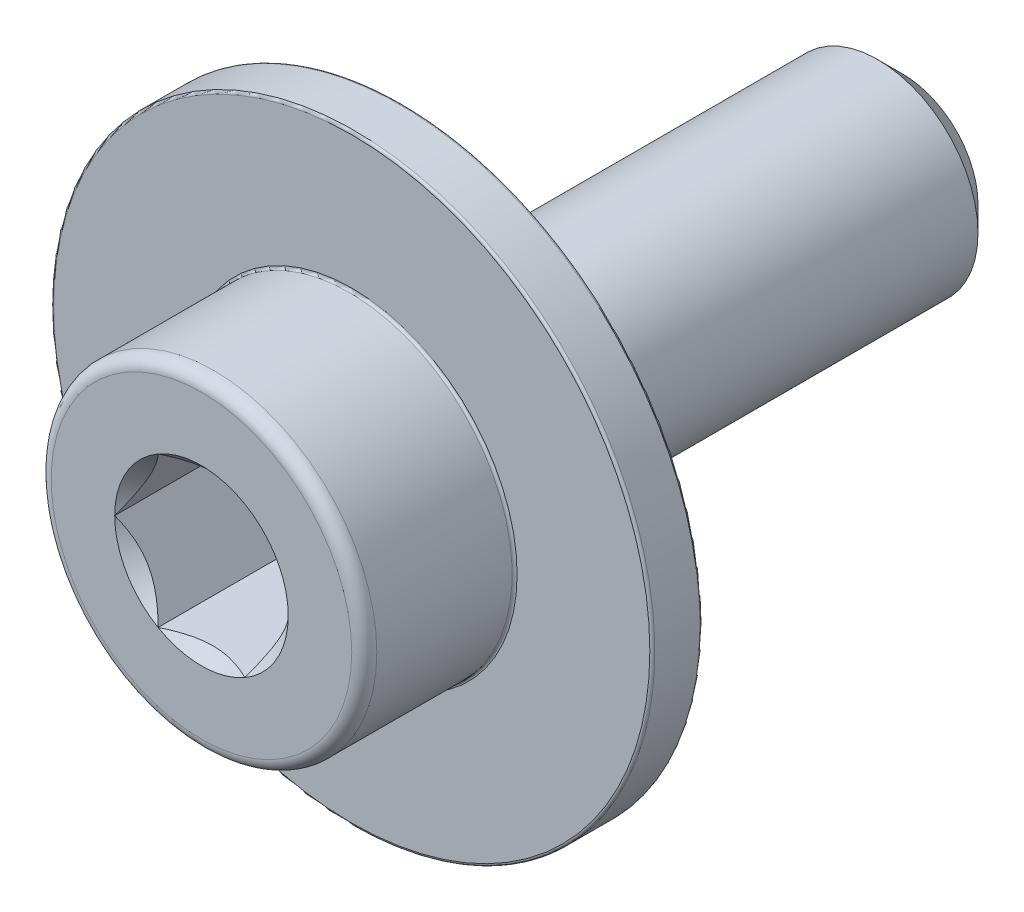
ISO-10303-21;
HEADER;
FILE_DESCRIPTION(('STEP AP214'),'2;1');
FILE_NAME('part.step','',(''),(''),'','','');
FILE_SCHEMA(('AUTOMOTIVE_DESIGN { 1 0 10303 214 1 1 1 1 }'));
ENDSEC;
DATA;
#1=APPLICATION_CONTEXT('core data for automotive mechanical design processes');
#2=APPLICATION_PROTOCOL_DEFINITION('international standard','automotive_design',2000,#1);
#3=PRODUCT_CONTEXT('',#1,'mechanical');
#4=PRODUCT('Part','Part','',(#3));
#5=PRODUCT_RELATED_PRODUCT_CATEGORY('part','',(#4));
#6=PRODUCT_DEFINITION_FORMATION('','',#4);
#7=PRODUCT_DEFINITION_CONTEXT('part definition',#1,'design');
#8=PRODUCT_DEFINITION('design','',#6,#7);
#9=PRODUCT_DEFINITION_SHAPE('','',#8);
#10=(LENGTH_UNIT() NAMED_UNIT(*) SI_UNIT(.MILLI.,.METRE.));
#11=(NAMED_UNIT(*) PLANE_ANGLE_UNIT() SI_UNIT($,.RADIAN.));
#12=(NAMED_UNIT(*) SI_UNIT($,.STERADIAN.) SOLID_ANGLE_UNIT());
#13=UNCERTAINTY_MEASURE_WITH_UNIT(LENGTH_MEASURE(1.E-05),#10,'distance_accuracy_value','');
#14=(GEOMETRIC_REPRESENTATION_CONTEXT(3) GLOBAL_UNCERTAINTY_ASSIGNED_CONTEXT((#13)) GLOBAL_UNIT_ASSIGNED_CONTEXT((#10,
#11,#12)) REPRESENTATION_CONTEXT('',''));
#15=CARTESIAN_POINT('',(0.,0.,0.));
#16=DIRECTION('',(0.,0.,1.));
#17=DIRECTION('',(1.,0.,0.));
#18=AXIS2_PLACEMENT_3D('',#15,#16,#17);
#19=CARTESIAN_POINT('',(0.,0.,28.));
#20=DIRECTION('',(0.,0.,-1.));
#21=DIRECTION('',(-1.,0.,0.));
#22=AXIS2_PLACEMENT_3D('',#19,#20,#21);
#23=CYLINDRICAL_SURFACE('',#22,6.5);
#24=CARTESIAN_POINT('',(0.,0.,22.1));
#25=DIRECTION('',(0.,0.,-1.));
#26=DIRECTION('',(-1.,0.,0.));
#27=AXIS2_PLACEMENT_3D('',#24,#25,#26);
#28=CIRCLE('',#27,6.5);
#29=CARTESIAN_POINT('',(-6.5,0.,22.1));
#30=VERTEX_POINT('',#29);
#31=EDGE_CURVE('E11',#30,#30,#28,.F.);
#32=ORIENTED_EDGE('',*,*,#31,.T.);
#33=EDGE_LOOP('',(#32));
#34=FACE_BOUND('',#33,.T.);
#35=CARTESIAN_POINT('',(0.,0.,27.5));
#36=DIRECTION('',(0.,0.,1.));
#37=DIRECTION('',(1.,0.,0.));
#38=AXIS2_PLACEMENT_3D('',#35,#36,#37);
#39=CIRCLE('',#38,6.5);
#40=CARTESIAN_POINT('',(6.5,0.,27.5));
#41=VERTEX_POINT('',#40);
#42=EDGE_CURVE('E257',#41,#41,#39,.F.);
#43=ORIENTED_EDGE('',*,*,#42,.T.);
#44=EDGE_LOOP('',(#43));
#45=FACE_BOUND('',#44,.T.);
#46=ADVANCED_FACE('F35',(#34,#45),#23,.T.);
#47=CARTESIAN_POINT('',(0.,0.,28.));
#48=DIRECTION('',(0.,0.,1.));
#49=DIRECTION('',(1.,0.,0.));
#50=AXIS2_PLACEMENT_3D('',#47,#48,#49);
#51=PLANE('',#50);
#52=CARTESIAN_POINT('',(0.,0.,28.));
#53=DIRECTION('',(0.,0.,1.));
#54=DIRECTION('',(1.,0.,0.));
#55=AXIS2_PLACEMENT_3D('',#52,#53,#54);
#56=CIRCLE('',#55,6.);
#57=CARTESIAN_POINT('',(6.,0.,28.));
#58=VERTEX_POINT('',#57);
#59=EDGE_CURVE('E108',#58,#58,#56,.T.);
#60=ORIENTED_EDGE('',*,*,#59,.T.);
#61=EDGE_LOOP('',(#60));
#62=FACE_BOUND('',#61,.T.);
#63=CARTESIAN_POINT('',(0.,0.,28.));
#64=DIRECTION('',(0.,0.,1.));
#65=DIRECTION('',(1.,0.,0.));
#66=AXIS2_PLACEMENT_3D('',#63,#64,#65);
#67=CIRCLE('',#66,3.46410161513776);
#68=CARTESIAN_POINT('',(3.46410161513776,0.,28.));
#69=VERTEX_POINT('',#68);
#70=CARTESIAN_POINT('',(1.73205080756888,3.,28.));
#71=VERTEX_POINT('',#70);
#72=EDGE_CURVE('E89',#69,#71,#67,.T.);
#73=ORIENTED_EDGE('',*,*,#72,.F.);
#74=CARTESIAN_POINT('',(1.73205080756888,-3.,28.));
#75=VERTEX_POINT('',#74);
#76=EDGE_CURVE('E49',#75,#69,#67,.T.);
#77=ORIENTED_EDGE('',*,*,#76,.F.);
#78=CARTESIAN_POINT('',(-1.73205080756888,-3.,28.));
#79=VERTEX_POINT('',#78);
#80=EDGE_CURVE('E319',#79,#75,#67,.T.);
#81=ORIENTED_EDGE('',*,*,#80,.F.);
#82=CARTESIAN_POINT('',(-3.46410161513776,0.,28.));
#83=VERTEX_POINT('',#82);
#84=EDGE_CURVE('E56',#83,#79,#67,.T.);
#85=ORIENTED_EDGE('',*,*,#84,.F.);
#86=CARTESIAN_POINT('',(-1.73205080756888,3.,28.));
#87=VERTEX_POINT('',#86);
#88=EDGE_CURVE('E130',#87,#83,#67,.T.);
#89=ORIENTED_EDGE('',*,*,#88,.F.);
#90=EDGE_CURVE('E98',#71,#87,#67,.T.);
#91=ORIENTED_EDGE('',*,*,#90,.F.);
#92=EDGE_LOOP('',(#73,#77,#81,#85,#89,#91));
#93=FACE_BOUND('',#92,.T.);
#94=ADVANCED_FACE('F129',(#62,#93),#51,.T.);
#95=CARTESIAN_POINT('',(0.,0.,28.));
#96=DIRECTION('',(0.,0.,1.));
#97=DIRECTION('',(1.,0.,0.));
#98=AXIS2_PLACEMENT_3D('',#95,#96,#97);
#99=CONICAL_SURFACE('',#98,3.46410161513776,0.785398163397449);
#100=ORIENTED_EDGE('',*,*,#90,.T.);
#101=CARTESIAN_POINT('',(-3.40188153141397,3.,29.071623018675));
#102=CARTESIAN_POINT('',(-3.31880839496225,3.,29.0093307707653));
#103=CARTESIAN_POINT('',(-3.23526432463499,3.,28.9476562262713));
#104=CARTESIAN_POINT('',(-3.06705083944725,3.,28.825817186681));
#105=CARTESIAN_POINT('',(-2.98238114192822,3.,28.7656530822642));
#106=CARTESIAN_POINT('',(-2.81111390830011,3.,28.6466823260063));
#107=CARTESIAN_POINT('',(-2.72450651479474,3.,28.5878898159252));
#108=CARTESIAN_POINT('',(-2.5498128465526,3.,28.4725516902232));
#109=CARTESIAN_POINT('',(-2.46172667795769,3.,28.4160059143113));
#110=CARTESIAN_POINT('',(-2.27892768432208,3.,28.3026064434241));
#111=CARTESIAN_POINT('',(-2.1841177229421,3.,28.2459085325007));
#112=CARTESIAN_POINT('',(-1.99231796342786,3.,28.1363338489189));
#113=CARTESIAN_POINT('',(-1.89532845598629,3.,28.0834565706102));
#114=CARTESIAN_POINT('',(-1.6991502417869,3.,27.9826433846406));
#115=CARTESIAN_POINT('',(-1.59996871640864,3.,27.9346936118117));
#116=CARTESIAN_POINT('',(-1.39893527870468,3.,27.8448170133997));
#117=CARTESIAN_POINT('',(-1.29708458210817,3.,27.8028875002659));
#118=CARTESIAN_POINT('',(-1.0982186531427,3.,27.7293601977538));
#119=CARTESIAN_POINT('',(-1.00140329048655,3.,27.6972274830937));
#120=CARTESIAN_POINT('',(-0.805487586800685,3.,27.6407367466802));
#121=CARTESIAN_POINT('',(-0.706387084473375,3.,27.6163792755582));
#122=CARTESIAN_POINT('',(-0.508116211624926,3.,27.5771014895869));
#123=CARTESIAN_POINT('',(-0.408977763183684,3.,27.5620226377466));
#124=CARTESIAN_POINT('',(-0.209698791301063,3.,27.5415865192691));
#125=CARTESIAN_POINT('',(-0.109558431989066,3.,27.5362276857281));
#126=CARTESIAN_POINT('',(0.0873520516843386,3.,27.535609235846));
#127=CARTESIAN_POINT('',(0.184121252918254,3.,27.5400131533177));
#128=CARTESIAN_POINT('',(0.376804854524576,3.,27.557946416793));
#129=CARTESIAN_POINT('',(0.472719169351943,3.,27.5714766658715));
#130=CARTESIAN_POINT('',(0.664619663322418,3.,27.6071635369876));
#131=CARTESIAN_POINT('',(0.760578448954831,3.,27.6294651712297));
#132=CARTESIAN_POINT('',(0.950411386335506,3.,27.6815211461887));
#133=CARTESIAN_POINT('',(1.04428572934496,3.,27.7112748000321));
#134=CARTESIAN_POINT('',(1.23968230612517,3.,27.7805237867733));
#135=CARTESIAN_POINT('',(1.34095401081408,3.,27.8207192131534));
#136=CARTESIAN_POINT('',(1.54084264319092,3.,27.9072590407946));
#137=CARTESIAN_POINT('',(1.63945865301323,3.,27.9536055360041));
#138=CARTESIAN_POINT('',(1.83454570215359,3.,28.0513511324151));
#139=CARTESIAN_POINT('',(1.93100848905254,3.,28.1027665721575));
#140=CARTESIAN_POINT('',(2.12170828880385,3.,28.209507618301));
#141=CARTESIAN_POINT('',(2.21594570238894,3.,28.2648325134343));
#142=CARTESIAN_POINT('',(2.39783630702513,3.,28.3757799204079));
#143=CARTESIAN_POINT('',(2.48558325753569,3.,28.4312495308021));
#144=CARTESIAN_POINT('',(2.65957133871346,3.,28.5445092718899));
#145=CARTESIAN_POINT('',(2.74581235420106,3.,28.6022995789736));
#146=CARTESIAN_POINT('',(2.91628413803161,3.,28.7193054641893));
#147=CARTESIAN_POINT('',(3.00052556721126,3.,28.7785055655618));
#148=CARTESIAN_POINT('',(3.16785911169907,3.,28.8984622960703));
#149=CARTESIAN_POINT('',(3.25095153629611,3.,28.9592184932626));
#150=CARTESIAN_POINT('',(3.33356317170769,3.,29.0206105740407));
#151=B_SPLINE_CURVE_WITH_KNOTS('',3,(#101,#102,#103,#104,#105,#106,#107,#108,#109,#110,#111,
#112,#113,#114,#115,#116,#117,#118,#119,#120,#121,#122,#123,#124,#125,#126,#127,#128,#129,#130,
#131,#132,#133,#134,#135,#136,#137,#138,#139,#140,#141,#142,#143,#144,#145,#146,#147,#148,#149,
#150),.UNSPECIFIED.,.F.,.F.,(4,2,2,2,2,2,2,2,2,2,2,2,2,2,2,2,2,2,2,2,2,2,2,2,4),(0.,
0.311507889644127,0.623095538398645,0.937099065704866,1.25108015037407,1.58241857439006,
1.91371306604159,2.24404824101607,2.57423548692227,2.87999017792551,3.18576651722764,
3.486161620239,3.78650829411698,4.07666515932723,4.36685074054528,4.6620503227987,
4.95722270569223,5.28383771583299,5.61056419890145,5.93838056110906,6.26613743475899,
6.57752286720456,6.88893201218749,7.19780024979462,7.50658366111557),.UNSPECIFIED.);
#152=EDGE_CURVE('E103',#71,#87,#151,.F.);
#153=ORIENTED_EDGE('',*,*,#152,.F.);
#154=EDGE_LOOP('',(#100,#153));
#155=FACE_BOUND('',#154,.T.);
#156=ADVANCED_FACE('F104',(#155),#99,.F.);
#157=ORIENTED_EDGE('',*,*,#88,.T.);
#158=CARTESIAN_POINT('',(-1.73193533751504,3.0002,28.0001154758271));
#159=CARTESIAN_POINT('',(-1.79147372663452,2.89707648504425,27.9406283183218));
#160=CARTESIAN_POINT('',(-1.85200767512883,2.79222861066935,27.8846349794655));
#161=CARTESIAN_POINT('',(-1.97544301635334,2.5784323282189,27.7821125963789));
#162=CARTESIAN_POINT('',(-2.03835614749388,2.46946358862024,27.7356405937413));
#163=CARTESIAN_POINT('',(-2.16521745390422,2.24973336040297,27.6560331885163));
#164=CARTESIAN_POINT('',(-2.22913332270057,2.13902782823779,27.6226977006427));
#165=CARTESIAN_POINT('',(-2.35837216363117,1.91517958943467,27.5713375439793));
#166=CARTESIAN_POINT('',(-2.42369118784644,1.802043720793,27.5532745375356));
#167=CARTESIAN_POINT('',(-2.53626564359199,1.60705904380729,27.5369769084505));
#168=CARTESIAN_POINT('',(-2.58337569224233,1.52546204599786,27.5345643671738));
#169=CARTESIAN_POINT('',(-2.67751916315866,1.36240077116991,27.5386294346571));
#170=CARTESIAN_POINT('',(-2.7245525527757,1.28093655070101,27.5451101600283));
#171=CARTESIAN_POINT('',(-2.81817374583237,1.11877988766163,27.5665917225152));
#172=CARTESIAN_POINT('',(-2.86476099147974,1.03808841121569,27.5816020899673));
#173=CARTESIAN_POINT('',(-2.95713536549225,0.878091302108662,27.619323646066));
#174=CARTESIAN_POINT('',(-3.00292255491614,0.798785563690702,27.6420342443228));
#175=CARTESIAN_POINT('',(-3.0842086834051,0.657993859197245,27.6887606848539));
#176=CARTESIAN_POINT('',(-3.11988753362891,0.596196277853973,27.7115483276808));
#177=CARTESIAN_POINT('',(-3.19060468282508,0.473710582479779,27.7607962860574));
#178=CARTESIAN_POINT('',(-3.2256429622163,0.413022502364395,27.7872567136662));
#179=CARTESIAN_POINT('',(-3.29496858432308,0.292947002609136,27.8432569943914));
#180=CARTESIAN_POINT('',(-3.32925789884291,0.233556167704081,27.8727871644784));
#181=CARTESIAN_POINT('',(-3.39720147685869,0.115874438532731,27.9345390915755));
#182=CARTESIAN_POINT('',(-3.43085611477447,0.0575828957522658,27.9667591966594));
#183=CARTESIAN_POINT('',(-3.46421708519159,-0.000200000000000237,28.0001154758271));
#184=B_SPLINE_CURVE_WITH_KNOTS('',3,(#158,#159,#160,#161,#162,#163,#164,#165,#166,#167,#168,
#169,#170,#171,#172,#173,#174,#175,#176,#177,#178,#179,#180,#181,#182,#183),.UNSPECIFIED.,.F.,
.F.,(4,2,2,2,2,2,2,2,2,2,2,2,4),(0.,0.399603557139307,0.801535286397847,1.19708369162343,
1.59163620080173,1.87398941755845,2.15644160919093,2.43921001247426,2.72195674032138,
2.94657516661927,3.17120044767274,3.3951375283781,3.61893808380739),.UNSPECIFIED.);
#185=EDGE_CURVE('E97',#87,#83,#184,.T.);
#186=ORIENTED_EDGE('',*,*,#185,.F.);
#187=EDGE_LOOP('',(#157,#186));
#188=FACE_BOUND('',#187,.T.);
#189=ADVANCED_FACE('F325',(#188),#99,.F.);
#190=ORIENTED_EDGE('',*,*,#84,.T.);
#191=CARTESIAN_POINT('',(-3.46421708519159,0.000199999999999766,28.0001154758271));
#192=CARTESIAN_POINT('',(-3.40467869607211,-0.102923514955749,27.9406283183218));
#193=CARTESIAN_POINT('',(-3.3441447475778,-0.207771389330651,27.8846349794655));
#194=CARTESIAN_POINT('',(-3.22070940635329,-0.421567671781097,27.7821125963789));
#195=CARTESIAN_POINT('',(-3.15779627521275,-0.53053641137976,27.7356405937413));
#196=CARTESIAN_POINT('',(-3.03093496880241,-0.750266639597028,27.6560331885163));
#197=CARTESIAN_POINT('',(-2.96701910000606,-0.860972171762212,27.6226977006427));
#198=CARTESIAN_POINT('',(-2.83778025907546,-1.08482041056532,27.5713375439793));
#199=CARTESIAN_POINT('',(-2.77246123486019,-1.19795627920699,27.5532745375356));
#200=CARTESIAN_POINT('',(-2.65988677911464,-1.3929409561927,27.5369769084505));
#201=CARTESIAN_POINT('',(-2.6127767304643,-1.47453795400213,27.5345643671738));
#202=CARTESIAN_POINT('',(-2.51863325954798,-1.63759922883009,27.5386294346571));
#203=CARTESIAN_POINT('',(-2.47159986993094,-1.71906344929899,27.5451101600283));
#204=CARTESIAN_POINT('',(-2.37797867687426,-1.88122011233837,27.5665917225152));
#205=CARTESIAN_POINT('',(-2.33139143122689,-1.9619115887843,27.5816020899673));
#206=CARTESIAN_POINT('',(-2.23901705721438,-2.12190869789133,27.619323646066));
#207=CARTESIAN_POINT('',(-2.19322986779049,-2.20121443630929,27.6420342443228));
#208=CARTESIAN_POINT('',(-2.11194373930153,-2.34200614080275,27.6887606848539));
#209=CARTESIAN_POINT('',(-2.07626488907772,-2.40380372214602,27.7115483276808));
#210=CARTESIAN_POINT('',(-2.00554773988155,-2.52628941752022,27.7607962860574));
#211=CARTESIAN_POINT('',(-1.97050946049033,-2.5869774976356,27.7872567136662));
#212=CARTESIAN_POINT('',(-1.90118383838356,-2.70705299739086,27.8432569943914));
#213=CARTESIAN_POINT('',(-1.86689452386373,-2.76644383229592,27.8727871644784));
#214=CARTESIAN_POINT('',(-1.79895094584794,-2.88412556146727,27.9345390915755));
#215=CARTESIAN_POINT('',(-1.76529630793216,-2.94241710424774,27.9667591966594));
#216=CARTESIAN_POINT('',(-1.73193533751504,-3.0002,28.0001154758271));
#217=B_SPLINE_CURVE_WITH_KNOTS('',3,(#191,#192,#193,#194,#195,#196,#197,#198,#199,#200,#201,
#202,#203,#204,#205,#206,#207,#208,#209,#210,#211,#212,#213,#214,#215,#216),.UNSPECIFIED.,.F.,
.F.,(4,2,2,2,2,2,2,2,2,2,2,2,4),(0.,0.399603557139307,0.801535286397845,1.19708369162343,
1.59163620080173,1.87398941755844,2.15644160919092,2.43921001247425,2.72195674032138,
2.94657516661926,3.17120044767274,3.3951375283781,3.61893808380739),.UNSPECIFIED.);
#218=EDGE_CURVE('E140',#83,#79,#217,.T.);
#219=ORIENTED_EDGE('',*,*,#218,.F.);
#220=EDGE_LOOP('',(#190,#219));
#221=FACE_BOUND('',#220,.T.);
#222=ADVANCED_FACE('F327',(#221),#99,.F.);
#223=ORIENTED_EDGE('',*,*,#80,.T.);
#224=CARTESIAN_POINT('',(-3.40188153141397,-3.,29.071623018675));
#225=CARTESIAN_POINT('',(-3.31880839496224,-3.,29.0093307707653));
#226=CARTESIAN_POINT('',(-3.23526432463498,-3.,28.9476562262713));
#227=CARTESIAN_POINT('',(-3.06705083944724,-3.,28.825817186681));
#228=CARTESIAN_POINT('',(-2.98238114192821,-3.,28.7656530822642));
#229=CARTESIAN_POINT('',(-2.81111390830011,-3.,28.6466823260063));
#230=CARTESIAN_POINT('',(-2.72450651479473,-3.,28.5878898159252));
#231=CARTESIAN_POINT('',(-2.54981284655259,-3.,28.4725516902232));
#232=CARTESIAN_POINT('',(-2.46172667795768,-3.,28.4160059143113));
#233=CARTESIAN_POINT('',(-2.27892768432207,-3.,28.3026064434241));
#234=CARTESIAN_POINT('',(-2.18411772294209,-3.,28.2459085325007));
#235=CARTESIAN_POINT('',(-1.99231796342786,-3.,28.1363338489189));
#236=CARTESIAN_POINT('',(-1.89532845598629,-3.,28.0834565706102));
#237=CARTESIAN_POINT('',(-1.69915024178689,-3.,27.9826433846406));
#238=CARTESIAN_POINT('',(-1.59996871640864,-3.,27.9346936118117));
#239=CARTESIAN_POINT('',(-1.39893527870468,-3.,27.8448170133997));
#240=CARTESIAN_POINT('',(-1.29708458210817,-3.,27.8028875002659));
#241=CARTESIAN_POINT('',(-1.0982186531427,-3.,27.7293601977538));
#242=CARTESIAN_POINT('',(-1.00140329048654,-3.,27.6972274830937));
#243=CARTESIAN_POINT('',(-0.805487586800682,-3.,27.6407367466802));
#244=CARTESIAN_POINT('',(-0.706387084473371,-3.,27.6163792755582));
#245=CARTESIAN_POINT('',(-0.508116211624922,-3.,27.5771014895869));
#246=CARTESIAN_POINT('',(-0.40897776318368,-3.,27.5620226377466));
#247=CARTESIAN_POINT('',(-0.20969879130106,-3.,27.5415865192691));
#248=CARTESIAN_POINT('',(-0.109558431989063,-3.,27.5362276857281));
#249=CARTESIAN_POINT('',(0.087352051684342,-3.,27.535609235846));
#250=CARTESIAN_POINT('',(0.184121252918257,-3.,27.5400131533177));
#251=CARTESIAN_POINT('',(0.376804854524579,-3.,27.557946416793));
#252=CARTESIAN_POINT('',(0.472719169351946,-3.,27.5714766658715));
#253=CARTESIAN_POINT('',(0.664619663322421,-3.,27.6071635369876));
#254=CARTESIAN_POINT('',(0.760578448954834,-3.,27.6294651712297));
#255=CARTESIAN_POINT('',(0.950411386335509,-3.,27.6815211461887));
#256=CARTESIAN_POINT('',(1.04428572934496,-3.,27.7112748000321));
#257=CARTESIAN_POINT('',(1.23968230612517,-3.,27.7805237867733));
#258=CARTESIAN_POINT('',(1.34095401081408,-3.,27.8207192131534));
#259=CARTESIAN_POINT('',(1.54084264319093,-3.,27.9072590407946));
#260=CARTESIAN_POINT('',(1.63945865301323,-3.,27.9536055360041));
#261=CARTESIAN_POINT('',(1.8345457021536,-3.,28.0513511324151));
#262=CARTESIAN_POINT('',(1.93100848905254,-3.,28.1027665721575));
#263=CARTESIAN_POINT('',(2.12170828880386,-3.,28.2095076183011));
#264=CARTESIAN_POINT('',(2.21594570238895,-3.,28.2648325134343));
#265=CARTESIAN_POINT('',(2.39783630702514,-3.,28.3757799204079));
#266=CARTESIAN_POINT('',(2.48558325753569,-3.,28.4312495308021));
#267=CARTESIAN_POINT('',(2.65957133871347,-3.,28.5445092718899));
#268=CARTESIAN_POINT('',(2.74581235420107,-3.,28.6022995789736));
#269=CARTESIAN_POINT('',(2.91628413803161,-3.,28.7193054641893));
#270=CARTESIAN_POINT('',(3.00052556721127,-3.,28.7785055655619));
#271=CARTESIAN_POINT('',(3.16785911169908,-3.,28.8984622960703));
#272=CARTESIAN_POINT('',(3.25095153629611,-3.,28.9592184932626));
#273=CARTESIAN_POINT('',(3.3335631717077,-3.,29.0206105740407));
#274=B_SPLINE_CURVE_WITH_KNOTS('',3,(#224,#225,#226,#227,#228,#229,#230,#231,#232,#233,#234,
#235,#236,#237,#238,#239,#240,#241,#242,#243,#244,#245,#246,#247,#248,#249,#250,#251,#252,#253,
#254,#255,#256,#257,#258,#259,#260,#261,#262,#263,#264,#265,#266,#267,#268,#269,#270,#271,#272,
#273),.UNSPECIFIED.,.F.,.F.,(4,2,2,2,2,2,2,2,2,2,2,2,2,2,2,2,2,2,2,2,2,2,2,2,4),(0.,
0.311507889644127,0.62309553839864,0.937099065704863,1.25108015037407,1.58241857439005,
1.91371306604158,2.24404824101606,2.57423548692226,2.8799901779255,3.18576651722763,
3.486161620239,3.78650829411697,4.07666515932722,4.36685074054527,4.66205032279869,
4.95722270569222,5.28383771583299,5.61056419890145,5.93838056110906,6.26613743475899,
6.57752286720455,6.88893201218749,7.19780024979462,7.50658366111556),.UNSPECIFIED.);
#275=EDGE_CURVE('E170',#79,#75,#274,.T.);
#276=ORIENTED_EDGE('',*,*,#275,.F.);
#277=EDGE_LOOP('',(#223,#276));
#278=FACE_BOUND('',#277,.T.);
#279=ADVANCED_FACE('F320',(#278),#99,.F.);
#280=ORIENTED_EDGE('',*,*,#76,.T.);
#281=CARTESIAN_POINT('',(1.73193533751504,-3.0002,28.0001154758272));
#282=CARTESIAN_POINT('',(1.79147372663452,-2.89707648504425,27.9406283183218));
#283=CARTESIAN_POINT('',(1.85200767512883,-2.79222861066935,27.8846349794655));
#284=CARTESIAN_POINT('',(1.97544301635334,-2.57843232821891,27.7821125963789));
#285=CARTESIAN_POINT('',(2.03835614749388,-2.46946358862024,27.7356405937413));
#286=CARTESIAN_POINT('',(2.16521745390422,-2.24973336040297,27.6560331885163));
#287=CARTESIAN_POINT('',(2.22913332270057,-2.13902782823779,27.6226977006427));
#288=CARTESIAN_POINT('',(2.35837216363117,-1.91517958943468,27.5713375439793));
#289=CARTESIAN_POINT('',(2.42369118784644,-1.80204372079301,27.5532745375356));
#290=CARTESIAN_POINT('',(2.53626564359199,-1.6070590438073,27.5369769084505));
#291=CARTESIAN_POINT('',(2.58337569224233,-1.52546204599787,27.5345643671738));
#292=CARTESIAN_POINT('',(2.67751916315865,-1.36240077116991,27.5386294346571));
#293=CARTESIAN_POINT('',(2.7245525527757,-1.28093655070101,27.5451101600283));
#294=CARTESIAN_POINT('',(2.81817374583237,-1.11877988766163,27.5665917225152));
#295=CARTESIAN_POINT('',(2.86476099147974,-1.0380884112157,27.5816020899673));
#296=CARTESIAN_POINT('',(2.95713536549225,-0.878091302108666,27.619323646066));
#297=CARTESIAN_POINT('',(3.00292255491614,-0.798785563690705,27.6420342443228));
#298=CARTESIAN_POINT('',(3.0842086834051,-0.657993859197248,27.6887606848539));
#299=CARTESIAN_POINT('',(3.11988753362891,-0.596196277853976,27.7115483276808));
#300=CARTESIAN_POINT('',(3.19060468282508,-0.473710582479782,27.7607962860574));
#301=CARTESIAN_POINT('',(3.2256429622163,-0.413022502364398,27.7872567136662));
#302=CARTESIAN_POINT('',(3.29496858432308,-0.292947002609139,27.8432569943914));
#303=CARTESIAN_POINT('',(3.32925789884291,-0.233556167704084,27.8727871644784));
#304=CARTESIAN_POINT('',(3.39720147685869,-0.115874438532733,27.9345390915755));
#305=CARTESIAN_POINT('',(3.43085611477447,-0.0575828957522672,27.9667591966594));
#306=CARTESIAN_POINT('',(3.46421708519159,0.000199999999999132,28.0001154758271));
#307=B_SPLINE_CURVE_WITH_KNOTS('',3,(#281,#282,#283,#284,#285,#286,#287,#288,#289,#290,#291,
#292,#293,#294,#295,#296,#297,#298,#299,#300,#301,#302,#303,#304,#305,#306),.UNSPECIFIED.,.F.,
.F.,(4,2,2,2,2,2,2,2,2,2,2,2,4),(0.,0.399603557139308,0.801535286397848,1.19708369162343,
1.59163620080173,1.87398941755845,2.15644160919093,2.43921001247425,2.72195674032138,
2.94657516661927,3.17120044767274,3.3951375283781,3.61893808380739),.UNSPECIFIED.);
#308=EDGE_CURVE('E119',#75,#69,#307,.T.);
#309=ORIENTED_EDGE('',*,*,#308,.F.);
#310=EDGE_LOOP('',(#280,#309));
#311=FACE_BOUND('',#310,.T.);
#312=ADVANCED_FACE('F155',(#311),#99,.F.);
#313=ORIENTED_EDGE('',*,*,#72,.T.);
#314=CARTESIAN_POINT('',(3.46421708519159,-0.000199999999999999,28.0001154758272));
#315=CARTESIAN_POINT('',(3.40467869607211,0.102923514955748,27.9406283183218));
#316=CARTESIAN_POINT('',(3.3441447475778,0.20777138933065,27.8846349794655));
#317=CARTESIAN_POINT('',(3.2207094063533,0.421567671781096,27.7821125963789));
#318=CARTESIAN_POINT('',(3.15779627521275,0.53053641137976,27.7356405937413));
#319=CARTESIAN_POINT('',(3.03093496880242,0.750266639597029,27.6560331885163));
#320=CARTESIAN_POINT('',(2.96701910000607,0.860972171762213,27.6226977006427));
#321=CARTESIAN_POINT('',(2.83778025907546,1.08482041056533,27.5713375439793));
#322=CARTESIAN_POINT('',(2.7724612348602,1.197956279207,27.5532745375356));
#323=CARTESIAN_POINT('',(2.65988677911464,1.3929409561927,27.5369769084505));
#324=CARTESIAN_POINT('',(2.6127767304643,1.47453795400214,27.5345643671738));
#325=CARTESIAN_POINT('',(2.51863325954798,1.63759922883009,27.5386294346571));
#326=CARTESIAN_POINT('',(2.47159986993094,1.71906344929899,27.5451101600283));
#327=CARTESIAN_POINT('',(2.37797867687426,1.88122011233837,27.5665917225152));
#328=CARTESIAN_POINT('',(2.33139143122689,1.9619115887843,27.5816020899673));
#329=CARTESIAN_POINT('',(2.23901705721438,2.12190869789134,27.619323646066));
#330=CARTESIAN_POINT('',(2.19322986779049,2.2012144363093,27.6420342443228));
#331=CARTESIAN_POINT('',(2.11194373930153,2.34200614080275,27.6887606848539));
#332=CARTESIAN_POINT('',(2.07626488907772,2.40380372214603,27.7115483276808));
#333=CARTESIAN_POINT('',(2.00554773988155,2.52628941752022,27.7607962860574));
#334=CARTESIAN_POINT('',(1.97050946049034,2.5869774976356,27.7872567136662));
#335=CARTESIAN_POINT('',(1.90118383838356,2.70705299739086,27.8432569943914));
#336=CARTESIAN_POINT('',(1.86689452386373,2.76644383229592,27.8727871644784));
#337=CARTESIAN_POINT('',(1.79895094584795,2.88412556146727,27.9345390915755));
#338=CARTESIAN_POINT('',(1.76529630793217,2.94241710424774,27.9667591966594));
#339=CARTESIAN_POINT('',(1.73193533751504,3.0002,28.0001154758271));
#340=B_SPLINE_CURVE_WITH_KNOTS('',3,(#314,#315,#316,#317,#318,#319,#320,#321,#322,#323,#324,
#325,#326,#327,#328,#329,#330,#331,#332,#333,#334,#335,#336,#337,#338,#339),.UNSPECIFIED.,.F.,
.F.,(4,2,2,2,2,2,2,2,2,2,2,2,4),(0.,0.399603557139308,0.801535286397847,1.19708369162343,
1.59163620080173,1.87398941755845,2.15644160919093,2.43921001247425,2.72195674032138,
2.94657516661927,3.17120044767275,3.3951375283781,3.61893808380739),.UNSPECIFIED.);
#341=EDGE_CURVE('E93',#69,#71,#340,.T.);
#342=ORIENTED_EDGE('',*,*,#341,.F.);
#343=EDGE_LOOP('',(#313,#342));
#344=FACE_BOUND('',#343,.T.);
#345=ADVANCED_FACE('F91',(#344),#99,.F.);
#346=CARTESIAN_POINT('',(0.,0.,22.));
#347=DIRECTION('',(0.,0.,1.));
#348=DIRECTION('',(1.,0.,0.));
#349=AXIS2_PLACEMENT_3D('',#346,#347,#348);
#350=PLANE('',#349);
#351=DIRECTION('',(-0.5,0.866025403784439,0.));
#352=VECTOR('',#351,1.);
#353=CARTESIAN_POINT('',(3.46410161513776,0.,22.));
#354=LINE('',#353,#352);
#355=CARTESIAN_POINT('',(3.46410161513776,0.,22.));
#356=VERTEX_POINT('',#355);
#357=CARTESIAN_POINT('',(1.73205080756888,3.,22.));
#358=VERTEX_POINT('',#357);
#359=EDGE_CURVE('E118',#356,#358,#354,.T.);
#360=ORIENTED_EDGE('',*,*,#359,.T.);
#361=DIRECTION('',(-1.,0.,0.));
#362=VECTOR('',#361,1.);
#363=CARTESIAN_POINT('',(1.73205080756888,3.,22.));
#364=LINE('',#363,#362);
#365=CARTESIAN_POINT('',(-1.73205080756888,3.,22.));
#366=VERTEX_POINT('',#365);
#367=EDGE_CURVE('E123',#358,#366,#364,.T.);
#368=ORIENTED_EDGE('',*,*,#367,.T.);
#369=DIRECTION('',(-0.5,-0.866025403784439,0.));
#370=VECTOR('',#369,1.);
#371=CARTESIAN_POINT('',(-1.73205080756888,3.,22.));
#372=LINE('',#371,#370);
#373=CARTESIAN_POINT('',(-3.46410161513775,0.,22.));
#374=VERTEX_POINT('',#373);
#375=EDGE_CURVE('E309',#366,#374,#372,.T.);
#376=ORIENTED_EDGE('',*,*,#375,.T.);
#377=DIRECTION('',(0.5,-0.866025403784439,0.));
#378=VECTOR('',#377,1.);
#379=CARTESIAN_POINT('',(-3.46410161513775,0.,22.));
#380=LINE('',#379,#378);
#381=CARTESIAN_POINT('',(-1.73205080756887,-3.,22.));
#382=VERTEX_POINT('',#381);
#383=EDGE_CURVE('E306',#374,#382,#380,.T.);
#384=ORIENTED_EDGE('',*,*,#383,.T.);
#385=DIRECTION('',(1.,0.,0.));
#386=VECTOR('',#385,1.);
#387=CARTESIAN_POINT('',(-1.73205080756887,-3.,22.));
#388=LINE('',#387,#386);
#389=CARTESIAN_POINT('',(1.73205080756888,-3.,22.));
#390=VERTEX_POINT('',#389);
#391=EDGE_CURVE('E303',#382,#390,#388,.T.);
#392=ORIENTED_EDGE('',*,*,#391,.T.);
#393=DIRECTION('',(0.5,0.866025403784439,0.));
#394=VECTOR('',#393,1.);
#395=CARTESIAN_POINT('',(1.73205080756888,-3.,22.));
#396=LINE('',#395,#394);
#397=EDGE_CURVE('E126',#390,#356,#396,.T.);
#398=ORIENTED_EDGE('',*,*,#397,.T.);
#399=EDGE_LOOP('',(#360,#368,#376,#384,#392,#398));
#400=FACE_BOUND('',#399,.T.);
#401=ADVANCED_FACE('F154',(#400),#350,.T.);
#402=CARTESIAN_POINT('',(1.73205080756888,3.,22.));
#403=DIRECTION('',(0.,1.,0.));
#404=DIRECTION('',(-1.,0.,0.));
#405=AXIS2_PLACEMENT_3D('',#402,#403,#404);
#406=PLANE('',#405);
#407=DIRECTION('',(0.,0.,1.));
#408=VECTOR('',#407,1.);
#409=CARTESIAN_POINT('',(1.73205080756888,3.,22.));
#410=LINE('',#409,#408);
#411=EDGE_CURVE('E115',#358,#71,#410,.T.);
#412=ORIENTED_EDGE('',*,*,#411,.T.);
#413=ORIENTED_EDGE('',*,*,#152,.T.);
#414=DIRECTION('',(0.,0.,1.));
#415=VECTOR('',#414,1.);
#416=CARTESIAN_POINT('',(-1.73205080756888,3.,22.));
#417=LINE('',#416,#415);
#418=EDGE_CURVE('E125',#366,#87,#417,.T.);
#419=ORIENTED_EDGE('',*,*,#418,.F.);
#420=ORIENTED_EDGE('',*,*,#367,.F.);
#421=EDGE_LOOP('',(#412,#413,#419,#420));
#422=FACE_BOUND('',#421,.T.);
#423=ADVANCED_FACE('F121',(#422),#406,.F.);
#424=CARTESIAN_POINT('',(-1.73205080756888,3.,22.));
#425=DIRECTION('',(-0.866025403784439,0.5,0.));
#426=DIRECTION('',(-0.5,-0.866025403784439,0.));
#427=AXIS2_PLACEMENT_3D('',#424,#425,#426);
#428=PLANE('',#427);
#429=ORIENTED_EDGE('',*,*,#418,.T.);
#430=ORIENTED_EDGE('',*,*,#185,.T.);
#431=DIRECTION('',(0.,0.,1.));
#432=VECTOR('',#431,1.);
#433=CARTESIAN_POINT('',(-3.46410161513775,0.,22.));
#434=LINE('',#433,#432);
#435=EDGE_CURVE('E295',#374,#83,#434,.T.);
#436=ORIENTED_EDGE('',*,*,#435,.F.);
#437=ORIENTED_EDGE('',*,*,#375,.F.);
#438=EDGE_LOOP('',(#429,#430,#436,#437));
#439=FACE_BOUND('',#438,.T.);
#440=ADVANCED_FACE('F147',(#439),#428,.F.);
#441=CARTESIAN_POINT('',(-3.46410161513775,0.,22.));
#442=DIRECTION('',(-0.866025403784439,-0.5,0.));
#443=DIRECTION('',(0.5,-0.866025403784439,0.));
#444=AXIS2_PLACEMENT_3D('',#441,#442,#443);
#445=PLANE('',#444);
#446=ORIENTED_EDGE('',*,*,#435,.T.);
#447=ORIENTED_EDGE('',*,*,#218,.T.);
#448=DIRECTION('',(0.,0.,1.));
#449=VECTOR('',#448,1.);
#450=CARTESIAN_POINT('',(-1.73205080756887,-3.,22.));
#451=LINE('',#450,#449);
#452=EDGE_CURVE('E297',#382,#79,#451,.T.);
#453=ORIENTED_EDGE('',*,*,#452,.F.);
#454=ORIENTED_EDGE('',*,*,#383,.F.);
#455=EDGE_LOOP('',(#446,#447,#453,#454));
#456=FACE_BOUND('',#455,.T.);
#457=ADVANCED_FACE('F194',(#456),#445,.F.);
#458=CARTESIAN_POINT('',(-1.73205080756887,-3.,22.));
#459=DIRECTION('',(0.,-1.,0.));
#460=DIRECTION('',(1.,0.,0.));
#461=AXIS2_PLACEMENT_3D('',#458,#459,#460);
#462=PLANE('',#461);
#463=ORIENTED_EDGE('',*,*,#452,.T.);
#464=ORIENTED_EDGE('',*,*,#275,.T.);
#465=DIRECTION('',(0.,0.,1.));
#466=VECTOR('',#465,1.);
#467=CARTESIAN_POINT('',(1.73205080756888,-3.,22.));
#468=LINE('',#467,#466);
#469=EDGE_CURVE('E287',#390,#75,#468,.T.);
#470=ORIENTED_EDGE('',*,*,#469,.F.);
#471=ORIENTED_EDGE('',*,*,#391,.F.);
#472=EDGE_LOOP('',(#463,#464,#470,#471));
#473=FACE_BOUND('',#472,.T.);
#474=ADVANCED_FACE('F190',(#473),#462,.F.);
#475=CARTESIAN_POINT('',(1.73205080756888,-3.,22.));
#476=DIRECTION('',(0.866025403784439,-0.5,0.));
#477=DIRECTION('',(0.5,0.866025403784439,0.));
#478=AXIS2_PLACEMENT_3D('',#475,#476,#477);
#479=PLANE('',#478);
#480=ORIENTED_EDGE('',*,*,#469,.T.);
#481=ORIENTED_EDGE('',*,*,#308,.T.);
#482=DIRECTION('',(0.,0.,1.));
#483=VECTOR('',#482,1.);
#484=CARTESIAN_POINT('',(3.46410161513776,0.,22.));
#485=LINE('',#484,#483);
#486=EDGE_CURVE('E117',#356,#69,#485,.T.);
#487=ORIENTED_EDGE('',*,*,#486,.F.);
#488=ORIENTED_EDGE('',*,*,#397,.F.);
#489=EDGE_LOOP('',(#480,#481,#487,#488));
#490=FACE_BOUND('',#489,.T.);
#491=ADVANCED_FACE('F187',(#490),#479,.F.);
#492=CARTESIAN_POINT('',(3.46410161513776,0.,22.));
#493=DIRECTION('',(0.866025403784438,0.5,0.));
#494=DIRECTION('',(-0.5,0.866025403784439,0.));
#495=AXIS2_PLACEMENT_3D('',#492,#493,#494);
#496=PLANE('',#495);
#497=ORIENTED_EDGE('',*,*,#486,.T.);
#498=ORIENTED_EDGE('',*,*,#341,.T.);
#499=ORIENTED_EDGE('',*,*,#411,.F.);
#500=ORIENTED_EDGE('',*,*,#359,.F.);
#501=EDGE_LOOP('',(#497,#498,#499,#500));
#502=FACE_BOUND('',#501,.T.);
#503=ADVANCED_FACE('F113',(#502),#496,.F.);
#504=CARTESIAN_POINT('',(0.,0.,27.5));
#505=DIRECTION('',(0.,0.,1.));
#506=DIRECTION('',(1.,0.,0.));
#507=AXIS2_PLACEMENT_3D('',#504,#505,#506);
#508=TOROIDAL_SURFACE('',#507,6.,0.5);
#509=ORIENTED_EDGE('',*,*,#42,.F.);
#510=EDGE_LOOP('',(#509));
#511=FACE_BOUND('',#510,.T.);
#512=ORIENTED_EDGE('',*,*,#59,.F.);
#513=EDGE_LOOP('',(#512));
#514=FACE_BOUND('',#513,.T.);
#515=ADVANCED_FACE('F229',(#511,#514),#508,.T.);
#516=CARTESIAN_POINT('',(0.,0.,22.));
#517=DIRECTION('',(0.,0.,-1.));
#518=DIRECTION('',(-1.,0.,0.));
#519=AXIS2_PLACEMENT_3D('',#516,#517,#518);
#520=CYLINDRICAL_SURFACE('',#519,12.);
#521=CARTESIAN_POINT('',(0.,0.,20.1));
#522=DIRECTION('',(0.,0.,1.));
#523=DIRECTION('',(1.,0.,0.));
#524=AXIS2_PLACEMENT_3D('',#521,#522,#523);
#525=CIRCLE('',#524,12.);
#526=CARTESIAN_POINT('',(12.,0.,20.1));
#527=VERTEX_POINT('',#526);
#528=EDGE_CURVE('E250',#527,#527,#525,.T.);
#529=ORIENTED_EDGE('',*,*,#528,.T.);
#530=EDGE_LOOP('',(#529));
#531=FACE_BOUND('',#530,.T.);
#532=CARTESIAN_POINT('',(0.,0.,21.9));
#533=DIRECTION('',(0.,0.,-1.));
#534=DIRECTION('',(-1.,0.,0.));
#535=AXIS2_PLACEMENT_3D('',#532,#533,#534);
#536=CIRCLE('',#535,12.);
#537=CARTESIAN_POINT('',(-12.,0.,21.9));
#538=VERTEX_POINT('',#537);
#539=EDGE_CURVE('E248',#538,#538,#536,.T.);
#540=ORIENTED_EDGE('',*,*,#539,.T.);
#541=EDGE_LOOP('',(#540));
#542=FACE_BOUND('',#541,.T.);
#543=ADVANCED_FACE('F156',(#531,#542),#520,.T.);
#544=CARTESIAN_POINT('',(0.,0.,22.));
#545=DIRECTION('',(0.,0.,-1.));
#546=DIRECTION('',(-1.,0.,0.));
#547=AXIS2_PLACEMENT_3D('',#544,#545,#546);
#548=PLANE('',#547);
#549=CARTESIAN_POINT('',(0.,0.,22.));
#550=DIRECTION('',(0.,0.,-1.));
#551=DIRECTION('',(-1.,0.,0.));
#552=AXIS2_PLACEMENT_3D('',#549,#550,#551);
#553=CIRCLE('',#552,11.9);
#554=CARTESIAN_POINT('',(-11.9,0.,22.));
#555=VERTEX_POINT('',#554);
#556=EDGE_CURVE('E43',#555,#555,#553,.F.);
#557=ORIENTED_EDGE('',*,*,#556,.T.);
#558=EDGE_LOOP('',(#557));
#559=FACE_BOUND('',#558,.T.);
#560=CARTESIAN_POINT('',(0.,0.,22.));
#561=DIRECTION('',(0.,0.,-1.));
#562=DIRECTION('',(-1.,0.,0.));
#563=AXIS2_PLACEMENT_3D('',#560,#561,#562);
#564=CIRCLE('',#563,6.6);
#565=CARTESIAN_POINT('',(-6.6,0.,22.));
#566=VERTEX_POINT('',#565);
#567=EDGE_CURVE('E254',#566,#566,#564,.T.);
#568=ORIENTED_EDGE('',*,*,#567,.T.);
#569=EDGE_LOOP('',(#568));
#570=FACE_BOUND('',#569,.T.);
#571=ADVANCED_FACE('F220',(#559,#570),#548,.F.);
#572=CARTESIAN_POINT('',(0.,0.,0.));
#573=DIRECTION('',(0.,0.,1.));
#574=DIRECTION('',(1.,0.,0.));
#575=AXIS2_PLACEMENT_3D('',#572,#573,#574);
#576=PLANE('',#575);
#577=CARTESIAN_POINT('',(0.,0.,0.));
#578=DIRECTION('',(0.,0.,1.));
#579=DIRECTION('',(1.,0.,0.));
#580=AXIS2_PLACEMENT_3D('',#577,#578,#579);
#581=CIRCLE('',#580,2.99999999999999);
#582=CARTESIAN_POINT('',(2.99999999999999,0.,0.));
#583=VERTEX_POINT('',#582);
#584=EDGE_CURVE('E109',#583,#583,#581,.F.);
#585=ORIENTED_EDGE('',*,*,#584,.T.);
#586=EDGE_LOOP('',(#585));
#587=FACE_BOUND('',#586,.T.);
#588=ADVANCED_FACE('F216',(#587),#576,.F.);
#589=CARTESIAN_POINT('',(0.,0.,1.));
#590=DIRECTION('',(0.,0.,1.));
#591=DIRECTION('',(1.,0.,0.));
#592=AXIS2_PLACEMENT_3D('',#589,#590,#591);
#593=CONICAL_SURFACE('',#592,4.,0.785398163397452);
#594=ORIENTED_EDGE('',*,*,#584,.F.);
#595=EDGE_LOOP('',(#594));
#596=FACE_BOUND('',#595,.T.);
#597=CARTESIAN_POINT('',(0.,0.,1.));
#598=DIRECTION('',(0.,0.,1.));
#599=DIRECTION('',(1.,0.,0.));
#600=AXIS2_PLACEMENT_3D('',#597,#598,#599);
#601=CIRCLE('',#600,4.);
#602=CARTESIAN_POINT('',(4.,0.,1.));
#603=VERTEX_POINT('',#602);
#604=EDGE_CURVE('E283',#603,#603,#601,.T.);
#605=ORIENTED_EDGE('',*,*,#604,.F.);
#606=EDGE_LOOP('',(#605));
#607=FACE_BOUND('',#606,.T.);
#608=ADVANCED_FACE('F219',(#596,#607),#593,.T.);
#609=CARTESIAN_POINT('',(0.,0.,20.));
#610=DIRECTION('',(0.,0.,-1.));
#611=DIRECTION('',(-1.,0.,0.));
#612=AXIS2_PLACEMENT_3D('',#609,#610,#611);
#613=CYLINDRICAL_SURFACE('',#612,4.);
#614=ORIENTED_EDGE('',*,*,#604,.T.);
#615=EDGE_LOOP('',(#614));
#616=FACE_BOUND('',#615,.T.);
#617=CARTESIAN_POINT('',(0.,0.,20.));
#618=DIRECTION('',(0.,0.,1.));
#619=DIRECTION('',(1.,0.,0.));
#620=AXIS2_PLACEMENT_3D('',#617,#618,#619);
#621=CIRCLE('',#620,4.);
#622=CARTESIAN_POINT('',(4.,0.,20.));
#623=VERTEX_POINT('',#622);
#624=EDGE_CURVE('E281',#623,#623,#621,.T.);
#625=ORIENTED_EDGE('',*,*,#624,.F.);
#626=EDGE_LOOP('',(#625));
#627=FACE_BOUND('',#626,.T.);
#628=ADVANCED_FACE('F222',(#616,#627),#613,.T.);
#629=CARTESIAN_POINT('',(0.,0.,20.));
#630=DIRECTION('',(0.,0.,1.));
#631=DIRECTION('',(1.,0.,0.));
#632=AXIS2_PLACEMENT_3D('',#629,#630,#631);
#633=PLANE('',#632);
#634=CARTESIAN_POINT('',(0.,0.,20.));
#635=DIRECTION('',(0.,0.,1.));
#636=DIRECTION('',(1.,0.,0.));
#637=AXIS2_PLACEMENT_3D('',#634,#635,#636);
#638=CIRCLE('',#637,11.9);
#639=CARTESIAN_POINT('',(11.9,0.,20.));
#640=VERTEX_POINT('',#639);
#641=EDGE_CURVE('E251',#640,#640,#638,.F.);
#642=ORIENTED_EDGE('',*,*,#641,.T.);
#643=EDGE_LOOP('',(#642));
#644=FACE_BOUND('',#643,.T.);
#645=ORIENTED_EDGE('',*,*,#624,.T.);
#646=EDGE_LOOP('',(#645));
#647=FACE_BOUND('',#646,.T.);
#648=ADVANCED_FACE('F215',(#644,#647),#633,.F.);
#649=CARTESIAN_POINT('',(0.,0.,20.1));
#650=DIRECTION('',(0.,0.,1.));
#651=DIRECTION('',(1.,0.,0.));
#652=AXIS2_PLACEMENT_3D('',#649,#650,#651);
#653=TOROIDAL_SURFACE('',#652,11.9,0.1);
#654=ORIENTED_EDGE('',*,*,#528,.F.);
#655=EDGE_LOOP('',(#654));
#656=FACE_BOUND('',#655,.T.);
#657=ORIENTED_EDGE('',*,*,#641,.F.);
#658=EDGE_LOOP('',(#657));
#659=FACE_BOUND('',#658,.T.);
#660=ADVANCED_FACE('F233',(#656,#659),#653,.T.);
#661=CARTESIAN_POINT('',(0.,0.,21.9));
#662=DIRECTION('',(0.,0.,-1.));
#663=DIRECTION('',(-1.,0.,0.));
#664=AXIS2_PLACEMENT_3D('',#661,#662,#663);
#665=TOROIDAL_SURFACE('',#664,11.9,0.1);
#666=ORIENTED_EDGE('',*,*,#556,.F.);
#667=EDGE_LOOP('',(#666));
#668=FACE_BOUND('',#667,.T.);
#669=ORIENTED_EDGE('',*,*,#539,.F.);
#670=EDGE_LOOP('',(#669));
#671=FACE_BOUND('',#670,.T.);
#672=ADVANCED_FACE('F235',(#668,#671),#665,.T.);
#673=CARTESIAN_POINT('',(0.,0.,22.1));
#674=DIRECTION('',(0.,0.,-1.));
#675=DIRECTION('',(-1.,0.,0.));
#676=AXIS2_PLACEMENT_3D('',#673,#674,#675);
#677=TOROIDAL_SURFACE('',#676,6.6,0.1);
#678=ORIENTED_EDGE('',*,*,#31,.F.);
#679=EDGE_LOOP('',(#678));
#680=FACE_BOUND('',#679,.T.);
#681=ORIENTED_EDGE('',*,*,#567,.F.);
#682=EDGE_LOOP('',(#681));
#683=FACE_BOUND('',#682,.T.);
#684=ADVANCED_FACE('F37',(#680,#683),#677,.F.);
#685=CLOSED_SHELL('',(#46,#94,#156,#189,#222,#279,#312,#345,#401,#423,#440,#457,#474,#491,#503,
#515,#543,#571,#588,#608,#628,#648,#660,#672,#684));
#686=MANIFOLD_SOLID_BREP('B2',#685);
#687=ADVANCED_BREP_SHAPE_REPRESENTATION('',(#18,#686),#14);
#688=SHAPE_DEFINITION_REPRESENTATION(#9,#687);
ENDSEC;
END-ISO-10303-21;
